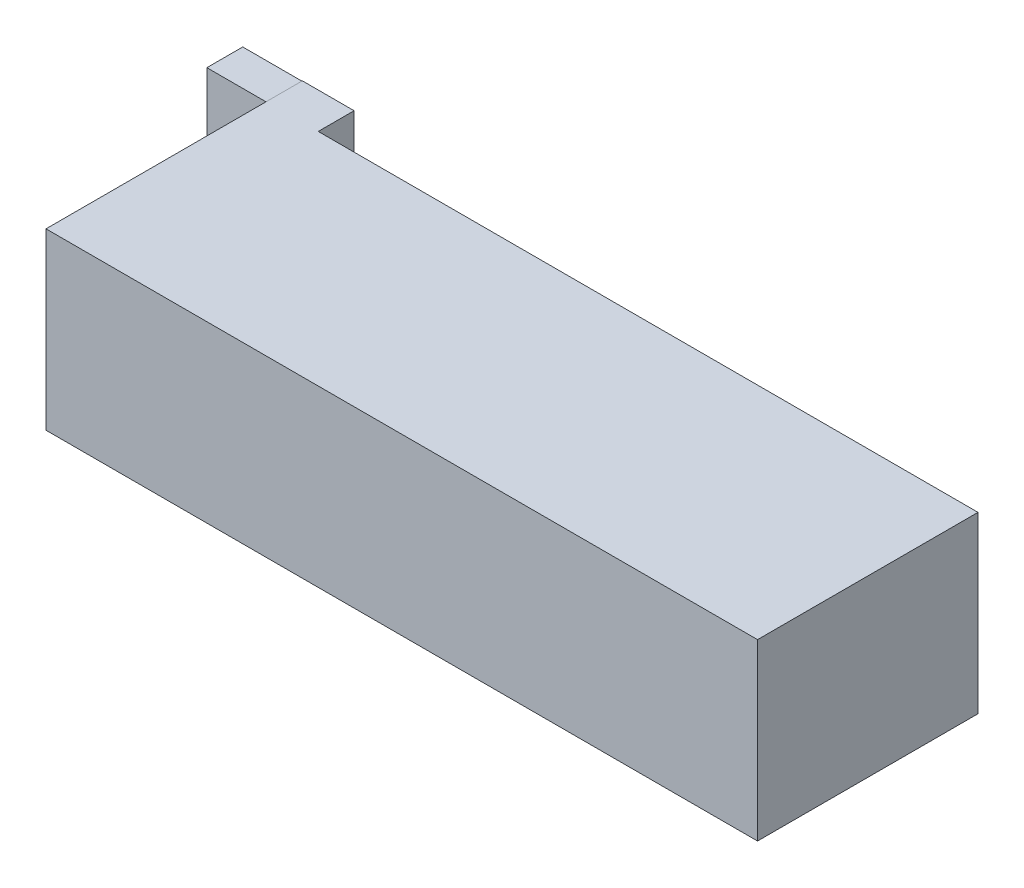
ISO-10303-21;
HEADER;
FILE_DESCRIPTION(('STEP AP214'),'2;1');
FILE_NAME('part.step','',(''),(''),'','','');
FILE_SCHEMA(('AUTOMOTIVE_DESIGN { 1 0 10303 214 1 1 1 1 }'));
ENDSEC;
DATA;
#1=APPLICATION_CONTEXT('core data for automotive mechanical design processes');
#2=APPLICATION_PROTOCOL_DEFINITION('international standard','automotive_design',2000,#1);
#3=PRODUCT_CONTEXT('',#1,'mechanical');
#4=PRODUCT('Part','Part','',(#3));
#5=PRODUCT_RELATED_PRODUCT_CATEGORY('part','',(#4));
#6=PRODUCT_DEFINITION_FORMATION('','',#4);
#7=PRODUCT_DEFINITION_CONTEXT('part definition',#1,'design');
#8=PRODUCT_DEFINITION('design','',#6,#7);
#9=PRODUCT_DEFINITION_SHAPE('','',#8);
#10=(LENGTH_UNIT() NAMED_UNIT(*) SI_UNIT(.MILLI.,.METRE.));
#11=(NAMED_UNIT(*) PLANE_ANGLE_UNIT() SI_UNIT($,.RADIAN.));
#12=(NAMED_UNIT(*) SI_UNIT($,.STERADIAN.) SOLID_ANGLE_UNIT());
#13=UNCERTAINTY_MEASURE_WITH_UNIT(LENGTH_MEASURE(1.E-05),#10,'distance_accuracy_value','');
#14=(GEOMETRIC_REPRESENTATION_CONTEXT(3) GLOBAL_UNCERTAINTY_ASSIGNED_CONTEXT((#13)) GLOBAL_UNIT_ASSIGNED_CONTEXT((#10,
#11,#12)) REPRESENTATION_CONTEXT('',''));
#15=CARTESIAN_POINT('',(0.,0.,0.));
#16=DIRECTION('',(0.,0.,1.));
#17=DIRECTION('',(1.,0.,0.));
#18=AXIS2_PLACEMENT_3D('',#15,#16,#17);
#19=CARTESIAN_POINT('',(0.,33.16,0.));
#20=DIRECTION('',(1.,0.,0.));
#21=DIRECTION('',(0.,0.,-1.));
#22=AXIS2_PLACEMENT_3D('',#19,#20,#21);
#23=PLANE('',#22);
#24=DIRECTION('',(0.,0.,-1.));
#25=VECTOR('',#24,1.);
#26=CARTESIAN_POINT('',(0.,33.0723258576313,-41.91));
#27=LINE('',#26,#25);
#28=CARTESIAN_POINT('',(0.,33.0723258576313,-41.91));
#29=VERTEX_POINT('',#28);
#30=CARTESIAN_POINT('',(0.,33.0723258576313,-48.73));
#31=VERTEX_POINT('',#30);
#32=EDGE_CURVE('E141',#29,#31,#27,.T.);
#33=ORIENTED_EDGE('',*,*,#32,.F.);
#34=DIRECTION('',(0.,-1.,0.));
#35=VECTOR('',#34,1.);
#36=CARTESIAN_POINT('',(0.,0.,-41.91));
#37=LINE('',#36,#35);
#38=CARTESIAN_POINT('',(0.,0.,-41.91));
#39=VERTEX_POINT('',#38);
#40=EDGE_CURVE('E132',#29,#39,#37,.T.);
#41=ORIENTED_EDGE('',*,*,#40,.T.);
#42=DIRECTION('',(0.,0.,1.));
#43=VECTOR('',#42,1.);
#44=CARTESIAN_POINT('',(0.,0.,0.));
#45=LINE('',#44,#43);
#46=CARTESIAN_POINT('',(0.,0.,0.));
#47=VERTEX_POINT('',#46);
#48=EDGE_CURVE('E131',#39,#47,#45,.T.);
#49=ORIENTED_EDGE('',*,*,#48,.T.);
#50=DIRECTION('',(0.,-1.,0.));
#51=VECTOR('',#50,1.);
#52=CARTESIAN_POINT('',(0.,33.16,0.));
#53=LINE('',#52,#51);
#54=CARTESIAN_POINT('',(0.,33.16,0.));
#55=VERTEX_POINT('',#54);
#56=EDGE_CURVE('E11',#55,#47,#53,.T.);
#57=ORIENTED_EDGE('',*,*,#56,.F.);
#58=DIRECTION('',(0.,0.,1.));
#59=VECTOR('',#58,1.);
#60=CARTESIAN_POINT('',(0.,33.16,0.));
#61=LINE('',#60,#59);
#62=CARTESIAN_POINT('',(0.,33.16,-48.73));
#63=VERTEX_POINT('',#62);
#64=EDGE_CURVE('E160',#63,#55,#61,.T.);
#65=ORIENTED_EDGE('',*,*,#64,.F.);
#66=DIRECTION('',(0.,-1.,0.));
#67=VECTOR('',#66,1.);
#68=CARTESIAN_POINT('',(0.,33.16,-48.73));
#69=LINE('',#68,#67);
#70=EDGE_CURVE('E151',#63,#31,#69,.T.);
#71=ORIENTED_EDGE('',*,*,#70,.T.);
#72=EDGE_LOOP('',(#33,#41,#49,#57,#65,#71));
#73=FACE_BOUND('',#72,.T.);
#74=ADVANCED_FACE('F41',(#73),#23,.F.);
#75=CARTESIAN_POINT('',(0.,33.16,-41.91));
#76=DIRECTION('',(0.,0.,1.));
#77=DIRECTION('',(1.,0.,0.));
#78=AXIS2_PLACEMENT_3D('',#75,#76,#77);
#79=PLANE('',#78);
#80=DIRECTION('',(0.,-1.,0.));
#81=VECTOR('',#80,1.);
#82=CARTESIAN_POINT('',(9.84,33.16,-41.91));
#83=LINE('',#82,#81);
#84=CARTESIAN_POINT('',(9.84,33.16,-41.91));
#85=VERTEX_POINT('',#84);
#86=CARTESIAN_POINT('',(9.84,0.,-41.91));
#87=VERTEX_POINT('',#86);
#88=EDGE_CURVE('E63',#85,#87,#83,.T.);
#89=ORIENTED_EDGE('',*,*,#88,.F.);
#90=DIRECTION('',(-1.,0.,0.));
#91=VECTOR('',#90,1.);
#92=CARTESIAN_POINT('',(0.,33.16,-41.91));
#93=LINE('',#92,#91);
#94=CARTESIAN_POINT('',(135.26,33.16,-41.91));
#95=VERTEX_POINT('',#94);
#96=EDGE_CURVE('E168',#95,#85,#93,.T.);
#97=ORIENTED_EDGE('',*,*,#96,.F.);
#98=DIRECTION('',(0.,-1.,0.));
#99=VECTOR('',#98,1.);
#100=CARTESIAN_POINT('',(135.26,33.16,-41.91));
#101=LINE('',#100,#99);
#102=CARTESIAN_POINT('',(135.26,0.,-41.91));
#103=VERTEX_POINT('',#102);
#104=EDGE_CURVE('E170',#95,#103,#101,.T.);
#105=ORIENTED_EDGE('',*,*,#104,.T.);
#106=DIRECTION('',(-1.,0.,0.));
#107=VECTOR('',#106,1.);
#108=CARTESIAN_POINT('',(0.,0.,-41.91));
#109=LINE('',#108,#107);
#110=EDGE_CURVE('E164',#103,#87,#109,.T.);
#111=ORIENTED_EDGE('',*,*,#110,.T.);
#112=EDGE_LOOP('',(#89,#97,#105,#111));
#113=FACE_BOUND('',#112,.T.);
#114=ADVANCED_FACE('F188',(#113),#79,.F.);
#115=CARTESIAN_POINT('',(0.,33.16,0.));
#116=DIRECTION('',(0.,0.,-1.));
#117=DIRECTION('',(-1.,0.,0.));
#118=AXIS2_PLACEMENT_3D('',#115,#116,#117);
#119=PLANE('',#118);
#120=DIRECTION('',(1.,0.,0.));
#121=VECTOR('',#120,1.);
#122=CARTESIAN_POINT('',(0.,0.,0.));
#123=LINE('',#122,#121);
#124=CARTESIAN_POINT('',(135.26,0.,0.));
#125=VERTEX_POINT('',#124);
#126=EDGE_CURVE('E172',#47,#125,#123,.T.);
#127=ORIENTED_EDGE('',*,*,#126,.T.);
#128=DIRECTION('',(0.,-1.,0.));
#129=VECTOR('',#128,1.);
#130=CARTESIAN_POINT('',(135.26,33.16,0.));
#131=LINE('',#130,#129);
#132=CARTESIAN_POINT('',(135.26,33.16,0.));
#133=VERTEX_POINT('',#132);
#134=EDGE_CURVE('E48',#133,#125,#131,.T.);
#135=ORIENTED_EDGE('',*,*,#134,.F.);
#136=DIRECTION('',(1.,0.,0.));
#137=VECTOR('',#136,1.);
#138=CARTESIAN_POINT('',(0.,33.16,0.));
#139=LINE('',#138,#137);
#140=EDGE_CURVE('E163',#55,#133,#139,.T.);
#141=ORIENTED_EDGE('',*,*,#140,.F.);
#142=ORIENTED_EDGE('',*,*,#56,.T.);
#143=EDGE_LOOP('',(#127,#135,#141,#142));
#144=FACE_BOUND('',#143,.T.);
#145=ADVANCED_FACE('F198',(#144),#119,.F.);
#146=CARTESIAN_POINT('',(135.26,33.16,0.));
#147=DIRECTION('',(-1.,0.,0.));
#148=DIRECTION('',(0.,0.,1.));
#149=AXIS2_PLACEMENT_3D('',#146,#147,#148);
#150=PLANE('',#149);
#151=DIRECTION('',(0.,0.,-1.));
#152=VECTOR('',#151,1.);
#153=CARTESIAN_POINT('',(135.26,0.,0.));
#154=LINE('',#153,#152);
#155=EDGE_CURVE('E174',#125,#103,#154,.T.);
#156=ORIENTED_EDGE('',*,*,#155,.T.);
#157=ORIENTED_EDGE('',*,*,#104,.F.);
#158=DIRECTION('',(0.,0.,-1.));
#159=VECTOR('',#158,1.);
#160=CARTESIAN_POINT('',(135.26,33.16,0.));
#161=LINE('',#160,#159);
#162=EDGE_CURVE('E166',#133,#95,#161,.T.);
#163=ORIENTED_EDGE('',*,*,#162,.F.);
#164=ORIENTED_EDGE('',*,*,#134,.T.);
#165=EDGE_LOOP('',(#156,#157,#163,#164));
#166=FACE_BOUND('',#165,.T.);
#167=ADVANCED_FACE('F183',(#166),#150,.F.);
#168=CARTESIAN_POINT('',(0.,33.16,0.));
#169=DIRECTION('',(0.,-1.,0.));
#170=DIRECTION('',(0.,0.,-1.));
#171=AXIS2_PLACEMENT_3D('',#168,#169,#170);
#172=PLANE('',#171);
#173=ORIENTED_EDGE('',*,*,#64,.T.);
#174=ORIENTED_EDGE('',*,*,#140,.T.);
#175=ORIENTED_EDGE('',*,*,#162,.T.);
#176=ORIENTED_EDGE('',*,*,#96,.T.);
#177=DIRECTION('',(0.,0.,-1.));
#178=VECTOR('',#177,1.);
#179=CARTESIAN_POINT('',(9.84,33.16,-41.91));
#180=LINE('',#179,#178);
#181=CARTESIAN_POINT('',(9.84,33.16,-48.73));
#182=VERTEX_POINT('',#181);
#183=EDGE_CURVE('E145',#85,#182,#180,.T.);
#184=ORIENTED_EDGE('',*,*,#183,.T.);
#185=DIRECTION('',(-1.,0.,0.));
#186=VECTOR('',#185,1.);
#187=CARTESIAN_POINT('',(0.,33.16,-48.73));
#188=LINE('',#187,#186);
#189=EDGE_CURVE('E147',#182,#63,#188,.T.);
#190=ORIENTED_EDGE('',*,*,#189,.T.);
#191=EDGE_LOOP('',(#173,#174,#175,#176,#184,#190));
#192=FACE_BOUND('',#191,.T.);
#193=ADVANCED_FACE('F195',(#192),#172,.F.);
#194=CARTESIAN_POINT('',(0.,0.,0.));
#195=DIRECTION('',(0.,-1.,0.));
#196=DIRECTION('',(0.,0.,-1.));
#197=AXIS2_PLACEMENT_3D('',#194,#195,#196);
#198=PLANE('',#197);
#199=ORIENTED_EDGE('',*,*,#48,.F.);
#200=DIRECTION('',(-1.,0.,0.));
#201=VECTOR('',#200,1.);
#202=CARTESIAN_POINT('',(0.,0.,-41.91));
#203=LINE('',#202,#201);
#204=CARTESIAN_POINT('',(-11.33,0.,-41.91));
#205=VERTEX_POINT('',#204);
#206=EDGE_CURVE('E55',#39,#205,#203,.T.);
#207=ORIENTED_EDGE('',*,*,#206,.T.);
#208=DIRECTION('',(0.,0.,-1.));
#209=VECTOR('',#208,1.);
#210=CARTESIAN_POINT('',(-11.33,0.,-41.91));
#211=LINE('',#210,#209);
#212=CARTESIAN_POINT('',(-11.33,0.,-48.73));
#213=VERTEX_POINT('',#212);
#214=EDGE_CURVE('E114',#205,#213,#211,.T.);
#215=ORIENTED_EDGE('',*,*,#214,.T.);
#216=DIRECTION('',(-1.,0.,0.));
#217=VECTOR('',#216,1.);
#218=CARTESIAN_POINT('',(0.,0.,-48.73));
#219=LINE('',#218,#217);
#220=CARTESIAN_POINT('',(9.84,0.,-48.73));
#221=VERTEX_POINT('',#220);
#222=EDGE_CURVE('E148',#221,#213,#219,.T.);
#223=ORIENTED_EDGE('',*,*,#222,.F.);
#224=DIRECTION('',(0.,0.,-1.));
#225=VECTOR('',#224,1.);
#226=CARTESIAN_POINT('',(9.84,0.,-41.91));
#227=LINE('',#226,#225);
#228=EDGE_CURVE('E143',#87,#221,#227,.T.);
#229=ORIENTED_EDGE('',*,*,#228,.F.);
#230=ORIENTED_EDGE('',*,*,#110,.F.);
#231=ORIENTED_EDGE('',*,*,#155,.F.);
#232=ORIENTED_EDGE('',*,*,#126,.F.);
#233=EDGE_LOOP('',(#199,#207,#215,#223,#229,#230,#231,#232));
#234=FACE_BOUND('',#233,.T.);
#235=ADVANCED_FACE('F129',(#234),#198,.T.);
#236=CARTESIAN_POINT('',(9.84,33.16,-41.91));
#237=DIRECTION('',(-1.,0.,0.));
#238=DIRECTION('',(0.,0.,1.));
#239=AXIS2_PLACEMENT_3D('',#236,#237,#238);
#240=PLANE('',#239);
#241=ORIENTED_EDGE('',*,*,#228,.T.);
#242=DIRECTION('',(0.,-1.,0.));
#243=VECTOR('',#242,1.);
#244=CARTESIAN_POINT('',(9.84,33.16,-48.73));
#245=LINE('',#244,#243);
#246=EDGE_CURVE('E156',#182,#221,#245,.T.);
#247=ORIENTED_EDGE('',*,*,#246,.F.);
#248=ORIENTED_EDGE('',*,*,#183,.F.);
#249=ORIENTED_EDGE('',*,*,#88,.T.);
#250=EDGE_LOOP('',(#241,#247,#248,#249));
#251=FACE_BOUND('',#250,.T.);
#252=ADVANCED_FACE('F191',(#251),#240,.F.);
#253=CARTESIAN_POINT('',(0.,33.16,-48.73));
#254=DIRECTION('',(0.,0.,1.));
#255=DIRECTION('',(1.,0.,0.));
#256=AXIS2_PLACEMENT_3D('',#253,#254,#255);
#257=PLANE('',#256);
#258=ORIENTED_EDGE('',*,*,#222,.T.);
#259=DIRECTION('',(0.,1.,0.));
#260=VECTOR('',#259,1.);
#261=CARTESIAN_POINT('',(-11.33,0.,-48.73));
#262=LINE('',#261,#260);
#263=CARTESIAN_POINT('',(-11.33,33.0723258576313,-48.73));
#264=VERTEX_POINT('',#263);
#265=EDGE_CURVE('E119',#213,#264,#262,.T.);
#266=ORIENTED_EDGE('',*,*,#265,.T.);
#267=DIRECTION('',(1.,0.,0.));
#268=VECTOR('',#267,1.);
#269=CARTESIAN_POINT('',(0.,33.0723258576313,-48.73));
#270=LINE('',#269,#268);
#271=EDGE_CURVE('E134',#264,#31,#270,.T.);
#272=ORIENTED_EDGE('',*,*,#271,.T.);
#273=ORIENTED_EDGE('',*,*,#70,.F.);
#274=ORIENTED_EDGE('',*,*,#189,.F.);
#275=ORIENTED_EDGE('',*,*,#246,.T.);
#276=EDGE_LOOP('',(#258,#266,#272,#273,#274,#275));
#277=FACE_BOUND('',#276,.T.);
#278=ADVANCED_FACE('F205',(#277),#257,.F.);
#279=CARTESIAN_POINT('',(0.,33.0723258576313,-41.91));
#280=DIRECTION('',(0.,1.,0.));
#281=DIRECTION('',(0.,0.,1.));
#282=AXIS2_PLACEMENT_3D('',#279,#280,#281);
#283=PLANE('',#282);
#284=ORIENTED_EDGE('',*,*,#271,.F.);
#285=DIRECTION('',(0.,0.,-1.));
#286=VECTOR('',#285,1.);
#287=CARTESIAN_POINT('',(-11.33,33.0723258576313,-41.91));
#288=LINE('',#287,#286);
#289=CARTESIAN_POINT('',(-11.33,33.0723258576313,-41.91));
#290=VERTEX_POINT('',#289);
#291=EDGE_CURVE('E122',#290,#264,#288,.T.);
#292=ORIENTED_EDGE('',*,*,#291,.F.);
#293=DIRECTION('',(1.,0.,0.));
#294=VECTOR('',#293,1.);
#295=CARTESIAN_POINT('',(0.,33.0723258576313,-41.91));
#296=LINE('',#295,#294);
#297=EDGE_CURVE('E123',#290,#29,#296,.T.);
#298=ORIENTED_EDGE('',*,*,#297,.T.);
#299=ORIENTED_EDGE('',*,*,#32,.T.);
#300=EDGE_LOOP('',(#284,#292,#298,#299));
#301=FACE_BOUND('',#300,.T.);
#302=ADVANCED_FACE('F203',(#301),#283,.T.);
#303=CARTESIAN_POINT('',(-11.33,0.,-41.91));
#304=DIRECTION('',(-1.,0.,0.));
#305=DIRECTION('',(0.,-1.,0.));
#306=AXIS2_PLACEMENT_3D('',#303,#304,#305);
#307=PLANE('',#306);
#308=ORIENTED_EDGE('',*,*,#265,.F.);
#309=ORIENTED_EDGE('',*,*,#214,.F.);
#310=DIRECTION('',(0.,1.,0.));
#311=VECTOR('',#310,1.);
#312=CARTESIAN_POINT('',(-11.33,0.,-41.91));
#313=LINE('',#312,#311);
#314=EDGE_CURVE('E116',#205,#290,#313,.T.);
#315=ORIENTED_EDGE('',*,*,#314,.T.);
#316=ORIENTED_EDGE('',*,*,#291,.T.);
#317=EDGE_LOOP('',(#308,#309,#315,#316));
#318=FACE_BOUND('',#317,.T.);
#319=ADVANCED_FACE('F115',(#318),#307,.T.);
#320=CARTESIAN_POINT('',(0.,0.,-41.91));
#321=DIRECTION('',(0.,0.,1.));
#322=DIRECTION('',(1.,0.,0.));
#323=AXIS2_PLACEMENT_3D('',#320,#321,#322);
#324=PLANE('',#323);
#325=ORIENTED_EDGE('',*,*,#40,.F.);
#326=ORIENTED_EDGE('',*,*,#297,.F.);
#327=ORIENTED_EDGE('',*,*,#314,.F.);
#328=ORIENTED_EDGE('',*,*,#206,.F.);
#329=EDGE_LOOP('',(#325,#326,#327,#328));
#330=FACE_BOUND('',#329,.T.);
#331=ADVANCED_FACE('F125',(#330),#324,.T.);
#332=CLOSED_SHELL('',(#74,#114,#145,#167,#193,#235,#252,#278,#302,#319,#331));
#333=MANIFOLD_SOLID_BREP('B2',#332);
#334=ADVANCED_BREP_SHAPE_REPRESENTATION('',(#18,#333),#14);
#335=SHAPE_DEFINITION_REPRESENTATION(#9,#334);
ENDSEC;
END-ISO-10303-21;
